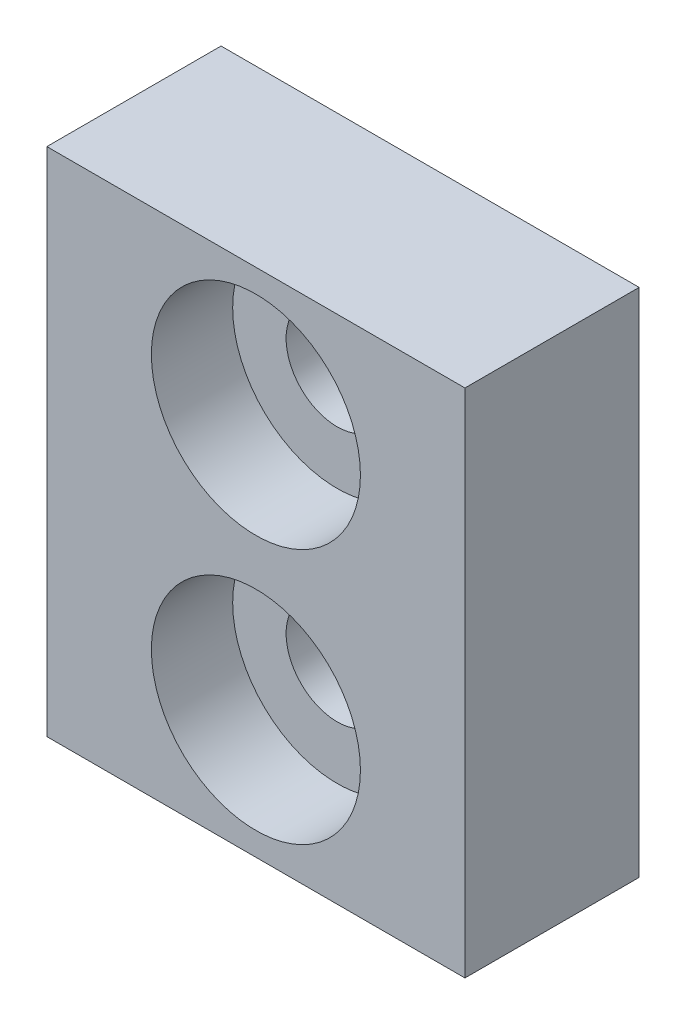
ISO-10303-21;
HEADER;
FILE_DESCRIPTION(('STEP AP214'),'2;1');
FILE_NAME('part.step','',(''),(''),'','','');
FILE_SCHEMA(('AUTOMOTIVE_DESIGN { 1 0 10303 214 1 1 1 1 }'));
ENDSEC;
DATA;
#1=APPLICATION_CONTEXT('core data for automotive mechanical design processes');
#2=APPLICATION_PROTOCOL_DEFINITION('international standard','automotive_design',2000,#1);
#3=PRODUCT_CONTEXT('',#1,'mechanical');
#4=PRODUCT('Part','Part','',(#3));
#5=PRODUCT_RELATED_PRODUCT_CATEGORY('part','',(#4));
#6=PRODUCT_DEFINITION_FORMATION('','',#4);
#7=PRODUCT_DEFINITION_CONTEXT('part definition',#1,'design');
#8=PRODUCT_DEFINITION('design','',#6,#7);
#9=PRODUCT_DEFINITION_SHAPE('','',#8);
#10=(LENGTH_UNIT() NAMED_UNIT(*) SI_UNIT(.MILLI.,.METRE.));
#11=(NAMED_UNIT(*) PLANE_ANGLE_UNIT() SI_UNIT($,.RADIAN.));
#12=(NAMED_UNIT(*) SI_UNIT($,.STERADIAN.) SOLID_ANGLE_UNIT());
#13=UNCERTAINTY_MEASURE_WITH_UNIT(LENGTH_MEASURE(1.E-05),#10,'distance_accuracy_value','');
#14=(GEOMETRIC_REPRESENTATION_CONTEXT(3) GLOBAL_UNCERTAINTY_ASSIGNED_CONTEXT((#13)) GLOBAL_UNIT_ASSIGNED_CONTEXT((#10,
#11,#12)) REPRESENTATION_CONTEXT('',''));
#15=CARTESIAN_POINT('',(0.,0.,0.));
#16=DIRECTION('',(0.,0.,1.));
#17=DIRECTION('',(1.,0.,0.));
#18=AXIS2_PLACEMENT_3D('',#15,#16,#17);
#19=CARTESIAN_POINT('',(0.,0.,7.5));
#20=DIRECTION('',(0.,0.,-1.));
#21=DIRECTION('',(-1.,0.,0.));
#22=AXIS2_PLACEMENT_3D('',#19,#20,#21);
#23=CYLINDRICAL_SURFACE('',#22,2.2);
#24=CARTESIAN_POINT('',(0.,0.,0.));
#25=DIRECTION('',(0.,0.,1.));
#26=DIRECTION('',(1.,0.,0.));
#27=AXIS2_PLACEMENT_3D('',#24,#25,#26);
#28=CIRCLE('',#27,2.2);
#29=CARTESIAN_POINT('',(2.2,0.,0.));
#30=VERTEX_POINT('',#29);
#31=EDGE_CURVE('E115',#30,#30,#28,.T.);
#32=ORIENTED_EDGE('',*,*,#31,.F.);
#33=EDGE_LOOP('',(#32));
#34=FACE_BOUND('',#33,.T.);
#35=CARTESIAN_POINT('',(0.,0.,4.));
#36=DIRECTION('',(0.,0.,1.));
#37=DIRECTION('',(1.,0.,0.));
#38=AXIS2_PLACEMENT_3D('',#35,#36,#37);
#39=CIRCLE('',#38,2.2);
#40=CARTESIAN_POINT('',(2.2,0.,4.));
#41=VERTEX_POINT('',#40);
#42=EDGE_CURVE('E37',#41,#41,#39,.T.);
#43=ORIENTED_EDGE('',*,*,#42,.T.);
#44=EDGE_LOOP('',(#43));
#45=FACE_BOUND('',#44,.T.);
#46=ADVANCED_FACE('F33',(#34,#45),#23,.F.);
#47=CARTESIAN_POINT('',(0.,0.,7.5));
#48=DIRECTION('',(0.,0.,-1.));
#49=DIRECTION('',(-1.,0.,0.));
#50=AXIS2_PLACEMENT_3D('',#47,#48,#49);
#51=PLANE('',#50);
#52=CARTESIAN_POINT('',(0.,0.,7.5));
#53=DIRECTION('',(0.,0.,1.));
#54=DIRECTION('',(1.,0.,0.));
#55=AXIS2_PLACEMENT_3D('',#52,#53,#54);
#56=CIRCLE('',#55,4.5);
#57=CARTESIAN_POINT('',(4.5,0.,7.5));
#58=VERTEX_POINT('',#57);
#59=EDGE_CURVE('E106',#58,#58,#56,.T.);
#60=ORIENTED_EDGE('',*,*,#59,.F.);
#61=EDGE_LOOP('',(#60));
#62=FACE_BOUND('',#61,.T.);
#63=DIRECTION('',(0.,1.,0.));
#64=VECTOR('',#63,1.);
#65=CARTESIAN_POINT('',(9.,-5.5,7.5));
#66=LINE('',#65,#64);
#67=CARTESIAN_POINT('',(9.,-16.5,7.5));
#68=VERTEX_POINT('',#67);
#69=CARTESIAN_POINT('',(9.,5.5,7.5));
#70=VERTEX_POINT('',#69);
#71=EDGE_CURVE('E83',#68,#70,#66,.T.);
#72=ORIENTED_EDGE('',*,*,#71,.T.);
#73=DIRECTION('',(-1.,0.,0.));
#74=VECTOR('',#73,1.);
#75=CARTESIAN_POINT('',(-9.,5.5,7.5));
#76=LINE('',#75,#74);
#77=CARTESIAN_POINT('',(-9.,5.5,7.5));
#78=VERTEX_POINT('',#77);
#79=EDGE_CURVE('E51',#70,#78,#76,.T.);
#80=ORIENTED_EDGE('',*,*,#79,.T.);
#81=DIRECTION('',(0.,-1.,0.));
#82=VECTOR('',#81,1.);
#83=CARTESIAN_POINT('',(-9.,-5.5,7.5));
#84=LINE('',#83,#82);
#85=CARTESIAN_POINT('',(-9.,-16.5,7.5));
#86=VERTEX_POINT('',#85);
#87=EDGE_CURVE('E67',#78,#86,#84,.T.);
#88=ORIENTED_EDGE('',*,*,#87,.T.);
#89=DIRECTION('',(-1.,0.,0.));
#90=VECTOR('',#89,1.);
#91=CARTESIAN_POINT('',(-9.,-16.5,7.5));
#92=LINE('',#91,#90);
#93=EDGE_CURVE('E90',#68,#86,#92,.T.);
#94=ORIENTED_EDGE('',*,*,#93,.F.);
#95=EDGE_LOOP('',(#72,#80,#88,#94));
#96=FACE_BOUND('',#95,.T.);
#97=CARTESIAN_POINT('',(0.,-11.,7.5));
#98=DIRECTION('',(0.,0.,-1.));
#99=DIRECTION('',(1.,0.,0.));
#100=AXIS2_PLACEMENT_3D('',#97,#98,#99);
#101=CIRCLE('',#100,4.5);
#102=CARTESIAN_POINT('',(4.5,-11.,7.5));
#103=VERTEX_POINT('',#102);
#104=EDGE_CURVE('E134',#103,#103,#101,.T.);
#105=ORIENTED_EDGE('',*,*,#104,.T.);
#106=EDGE_LOOP('',(#105));
#107=FACE_BOUND('',#106,.T.);
#108=ADVANCED_FACE('F127',(#62,#96,#107),#51,.F.);
#109=CARTESIAN_POINT('',(0.,0.,0.));
#110=DIRECTION('',(0.,0.,-1.));
#111=DIRECTION('',(-1.,0.,0.));
#112=AXIS2_PLACEMENT_3D('',#109,#110,#111);
#113=PLANE('',#112);
#114=DIRECTION('',(0.,1.,0.));
#115=VECTOR('',#114,1.);
#116=CARTESIAN_POINT('',(9.,-5.5,0.));
#117=LINE('',#116,#115);
#118=CARTESIAN_POINT('',(9.,-16.5,0.));
#119=VERTEX_POINT('',#118);
#120=CARTESIAN_POINT('',(9.,5.5,0.));
#121=VERTEX_POINT('',#120);
#122=EDGE_CURVE('E96',#119,#121,#117,.T.);
#123=ORIENTED_EDGE('',*,*,#122,.F.);
#124=DIRECTION('',(-1.,0.,0.));
#125=VECTOR('',#124,1.);
#126=CARTESIAN_POINT('',(-9.,-16.5,0.));
#127=LINE('',#126,#125);
#128=CARTESIAN_POINT('',(-9.,-16.5,0.));
#129=VERTEX_POINT('',#128);
#130=EDGE_CURVE('E89',#119,#129,#127,.T.);
#131=ORIENTED_EDGE('',*,*,#130,.T.);
#132=DIRECTION('',(0.,-1.,0.));
#133=VECTOR('',#132,1.);
#134=CARTESIAN_POINT('',(-9.,-5.5,0.));
#135=LINE('',#134,#133);
#136=CARTESIAN_POINT('',(-9.,5.5,0.));
#137=VERTEX_POINT('',#136);
#138=EDGE_CURVE('E77',#137,#129,#135,.T.);
#139=ORIENTED_EDGE('',*,*,#138,.F.);
#140=DIRECTION('',(-1.,0.,0.));
#141=VECTOR('',#140,1.);
#142=CARTESIAN_POINT('',(-9.,5.5,0.));
#143=LINE('',#142,#141);
#144=EDGE_CURVE('E62',#121,#137,#143,.T.);
#145=ORIENTED_EDGE('',*,*,#144,.F.);
#146=EDGE_LOOP('',(#123,#131,#139,#145));
#147=FACE_BOUND('',#146,.T.);
#148=ORIENTED_EDGE('',*,*,#31,.T.);
#149=EDGE_LOOP('',(#148));
#150=FACE_BOUND('',#149,.T.);
#151=CARTESIAN_POINT('',(0.,-11.,0.));
#152=DIRECTION('',(0.,0.,-1.));
#153=DIRECTION('',(1.,0.,0.));
#154=AXIS2_PLACEMENT_3D('',#151,#152,#153);
#155=CIRCLE('',#154,2.2);
#156=CARTESIAN_POINT('',(2.2,-11.,0.));
#157=VERTEX_POINT('',#156);
#158=EDGE_CURVE('E98',#157,#157,#155,.T.);
#159=ORIENTED_EDGE('',*,*,#158,.F.);
#160=EDGE_LOOP('',(#159));
#161=FACE_BOUND('',#160,.T.);
#162=ADVANCED_FACE('F93',(#147,#150,#161),#113,.T.);
#163=CARTESIAN_POINT('',(9.,-5.5,7.5));
#164=DIRECTION('',(-1.,0.,0.));
#165=DIRECTION('',(0.,0.,1.));
#166=AXIS2_PLACEMENT_3D('',#163,#164,#165);
#167=PLANE('',#166);
#168=ORIENTED_EDGE('',*,*,#122,.T.);
#169=DIRECTION('',(0.,0.,-1.));
#170=VECTOR('',#169,1.);
#171=CARTESIAN_POINT('',(9.,5.5,7.5));
#172=LINE('',#171,#170);
#173=EDGE_CURVE('E11',#70,#121,#172,.T.);
#174=ORIENTED_EDGE('',*,*,#173,.F.);
#175=ORIENTED_EDGE('',*,*,#71,.F.);
#176=DIRECTION('',(0.,0.,-1.));
#177=VECTOR('',#176,1.);
#178=CARTESIAN_POINT('',(9.,-16.5,7.5));
#179=LINE('',#178,#177);
#180=EDGE_CURVE('E91',#68,#119,#179,.T.);
#181=ORIENTED_EDGE('',*,*,#180,.T.);
#182=EDGE_LOOP('',(#168,#174,#175,#181));
#183=FACE_BOUND('',#182,.T.);
#184=ADVANCED_FACE('F35',(#183),#167,.F.);
#185=CARTESIAN_POINT('',(-9.,5.5,7.5));
#186=DIRECTION('',(0.,-1.,0.));
#187=DIRECTION('',(0.,0.,-1.));
#188=AXIS2_PLACEMENT_3D('',#185,#186,#187);
#189=PLANE('',#188);
#190=ORIENTED_EDGE('',*,*,#144,.T.);
#191=DIRECTION('',(0.,0.,-1.));
#192=VECTOR('',#191,1.);
#193=CARTESIAN_POINT('',(-9.,5.5,7.5));
#194=LINE('',#193,#192);
#195=EDGE_CURVE('E43',#78,#137,#194,.T.);
#196=ORIENTED_EDGE('',*,*,#195,.F.);
#197=ORIENTED_EDGE('',*,*,#79,.F.);
#198=ORIENTED_EDGE('',*,*,#173,.T.);
#199=EDGE_LOOP('',(#190,#196,#197,#198));
#200=FACE_BOUND('',#199,.T.);
#201=ADVANCED_FACE('F124',(#200),#189,.F.);
#202=CARTESIAN_POINT('',(-9.,-5.5,7.5));
#203=DIRECTION('',(1.,0.,0.));
#204=DIRECTION('',(0.,0.,-1.));
#205=AXIS2_PLACEMENT_3D('',#202,#203,#204);
#206=PLANE('',#205);
#207=ORIENTED_EDGE('',*,*,#138,.T.);
#208=DIRECTION('',(0.,0.,-1.));
#209=VECTOR('',#208,1.);
#210=CARTESIAN_POINT('',(-9.,-16.5,7.5));
#211=LINE('',#210,#209);
#212=EDGE_CURVE('E80',#86,#129,#211,.T.);
#213=ORIENTED_EDGE('',*,*,#212,.F.);
#214=ORIENTED_EDGE('',*,*,#87,.F.);
#215=ORIENTED_EDGE('',*,*,#195,.T.);
#216=EDGE_LOOP('',(#207,#213,#214,#215));
#217=FACE_BOUND('',#216,.T.);
#218=ADVANCED_FACE('F79',(#217),#206,.F.);
#219=CARTESIAN_POINT('',(0.,0.,4.));
#220=DIRECTION('',(0.,0.,1.));
#221=DIRECTION('',(1.,0.,0.));
#222=AXIS2_PLACEMENT_3D('',#219,#220,#221);
#223=CYLINDRICAL_SURFACE('',#222,4.5);
#224=CARTESIAN_POINT('',(0.,0.,4.));
#225=DIRECTION('',(0.,0.,1.));
#226=DIRECTION('',(1.,0.,0.));
#227=AXIS2_PLACEMENT_3D('',#224,#225,#226);
#228=CIRCLE('',#227,4.5);
#229=CARTESIAN_POINT('',(4.5,0.,4.));
#230=VERTEX_POINT('',#229);
#231=EDGE_CURVE('E110',#230,#230,#228,.T.);
#232=ORIENTED_EDGE('',*,*,#231,.F.);
#233=EDGE_LOOP('',(#232));
#234=FACE_BOUND('',#233,.T.);
#235=ORIENTED_EDGE('',*,*,#59,.T.);
#236=EDGE_LOOP('',(#235));
#237=FACE_BOUND('',#236,.T.);
#238=ADVANCED_FACE('F159',(#234,#237),#223,.F.);
#239=CARTESIAN_POINT('',(0.,0.,4.));
#240=DIRECTION('',(0.,0.,1.));
#241=DIRECTION('',(1.,0.,0.));
#242=AXIS2_PLACEMENT_3D('',#239,#240,#241);
#243=PLANE('',#242);
#244=ORIENTED_EDGE('',*,*,#42,.F.);
#245=EDGE_LOOP('',(#244));
#246=FACE_BOUND('',#245,.T.);
#247=ORIENTED_EDGE('',*,*,#231,.T.);
#248=EDGE_LOOP('',(#247));
#249=FACE_BOUND('',#248,.T.);
#250=ADVANCED_FACE('F200',(#246,#249),#243,.T.);
#251=CARTESIAN_POINT('',(0.,-11.,7.5));
#252=DIRECTION('',(0.,0.,-1.));
#253=DIRECTION('',(-1.,0.,0.));
#254=AXIS2_PLACEMENT_3D('',#251,#252,#253);
#255=CYLINDRICAL_SURFACE('',#254,2.2);
#256=ORIENTED_EDGE('',*,*,#158,.T.);
#257=EDGE_LOOP('',(#256));
#258=FACE_BOUND('',#257,.T.);
#259=CARTESIAN_POINT('',(0.,-11.,4.));
#260=DIRECTION('',(0.,0.,-1.));
#261=DIRECTION('',(1.,0.,0.));
#262=AXIS2_PLACEMENT_3D('',#259,#260,#261);
#263=CIRCLE('',#262,2.2);
#264=CARTESIAN_POINT('',(2.2,-11.,4.));
#265=VERTEX_POINT('',#264);
#266=EDGE_CURVE('E102',#265,#265,#263,.T.);
#267=ORIENTED_EDGE('',*,*,#266,.F.);
#268=EDGE_LOOP('',(#267));
#269=FACE_BOUND('',#268,.T.);
#270=ADVANCED_FACE('F207',(#258,#269),#255,.F.);
#271=CARTESIAN_POINT('',(-9.,-16.5,7.5));
#272=DIRECTION('',(0.,1.,0.));
#273=DIRECTION('',(0.,0.,-1.));
#274=AXIS2_PLACEMENT_3D('',#271,#272,#273);
#275=PLANE('',#274);
#276=ORIENTED_EDGE('',*,*,#130,.F.);
#277=ORIENTED_EDGE('',*,*,#180,.F.);
#278=ORIENTED_EDGE('',*,*,#93,.T.);
#279=ORIENTED_EDGE('',*,*,#212,.T.);
#280=EDGE_LOOP('',(#276,#277,#278,#279));
#281=FACE_BOUND('',#280,.T.);
#282=ADVANCED_FACE('F87',(#281),#275,.F.);
#283=CARTESIAN_POINT('',(0.,-11.,4.));
#284=DIRECTION('',(0.,0.,1.));
#285=DIRECTION('',(1.,0.,0.));
#286=AXIS2_PLACEMENT_3D('',#283,#284,#285);
#287=CYLINDRICAL_SURFACE('',#286,4.5);
#288=CARTESIAN_POINT('',(0.,-11.,4.));
#289=DIRECTION('',(0.,0.,-1.));
#290=DIRECTION('',(1.,0.,0.));
#291=AXIS2_PLACEMENT_3D('',#288,#289,#290);
#292=CIRCLE('',#291,4.5);
#293=CARTESIAN_POINT('',(4.5,-11.,4.));
#294=VERTEX_POINT('',#293);
#295=EDGE_CURVE('E109',#294,#294,#292,.T.);
#296=ORIENTED_EDGE('',*,*,#295,.T.);
#297=EDGE_LOOP('',(#296));
#298=FACE_BOUND('',#297,.T.);
#299=ORIENTED_EDGE('',*,*,#104,.F.);
#300=EDGE_LOOP('',(#299));
#301=FACE_BOUND('',#300,.T.);
#302=ADVANCED_FACE('F141',(#298,#301),#287,.F.);
#303=CARTESIAN_POINT('',(0.,-11.,4.));
#304=DIRECTION('',(0.,0.,1.));
#305=DIRECTION('',(1.,0.,0.));
#306=AXIS2_PLACEMENT_3D('',#303,#304,#305);
#307=PLANE('',#306);
#308=ORIENTED_EDGE('',*,*,#266,.T.);
#309=EDGE_LOOP('',(#308));
#310=FACE_BOUND('',#309,.T.);
#311=ORIENTED_EDGE('',*,*,#295,.F.);
#312=EDGE_LOOP('',(#311));
#313=FACE_BOUND('',#312,.T.);
#314=ADVANCED_FACE('F143',(#310,#313),#307,.T.);
#315=CLOSED_SHELL('',(#46,#108,#162,#184,#201,#218,#238,#250,#270,#282,#302,#314));
#316=MANIFOLD_SOLID_BREP('B2',#315);
#317=ADVANCED_BREP_SHAPE_REPRESENTATION('',(#18,#316),#14);
#318=SHAPE_DEFINITION_REPRESENTATION(#9,#317);
ENDSEC;
END-ISO-10303-21;
